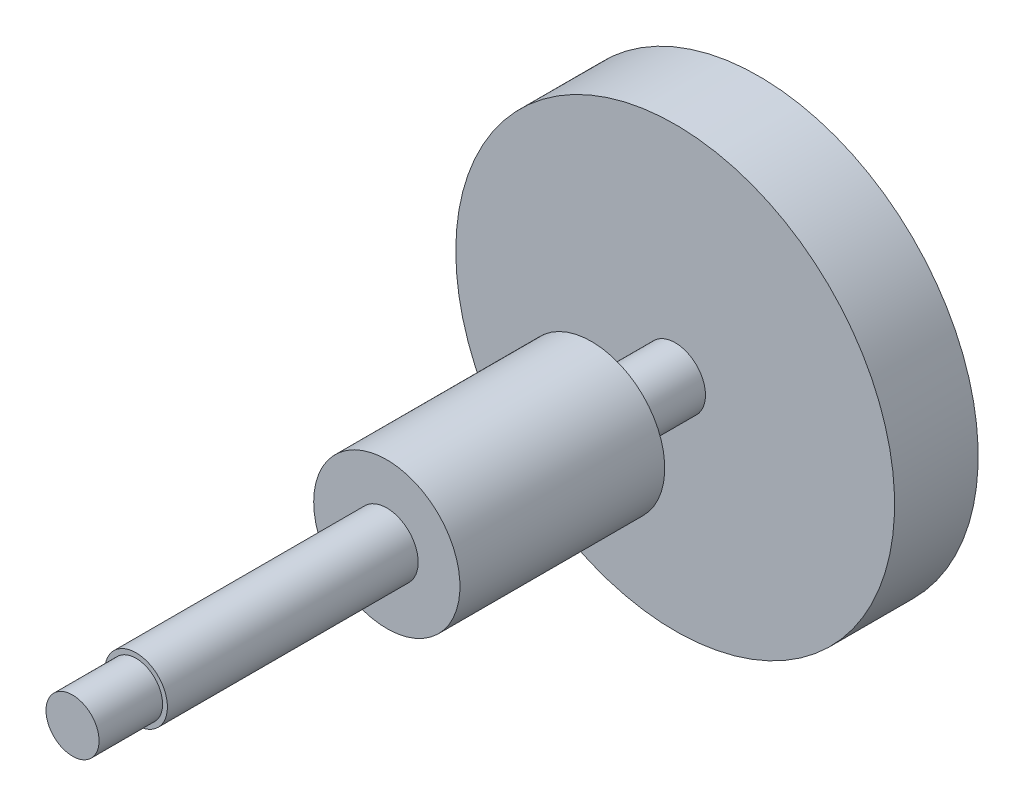
ISO-10303-21;
HEADER;
FILE_DESCRIPTION(('STEP AP214'),'2;1');
FILE_NAME('part.step','',(''),(''),'','','');
FILE_SCHEMA(('AUTOMOTIVE_DESIGN { 1 0 10303 214 1 1 1 1 }'));
ENDSEC;
DATA;
#1=APPLICATION_CONTEXT('core data for automotive mechanical design processes');
#2=APPLICATION_PROTOCOL_DEFINITION('international standard','automotive_design',2000,#1);
#3=PRODUCT_CONTEXT('',#1,'mechanical');
#4=PRODUCT('Part','Part','',(#3));
#5=PRODUCT_RELATED_PRODUCT_CATEGORY('part','',(#4));
#6=PRODUCT_DEFINITION_FORMATION('','',#4);
#7=PRODUCT_DEFINITION_CONTEXT('part definition',#1,'design');
#8=PRODUCT_DEFINITION('design','',#6,#7);
#9=PRODUCT_DEFINITION_SHAPE('','',#8);
#10=(LENGTH_UNIT() NAMED_UNIT(*) SI_UNIT(.MILLI.,.METRE.));
#11=(NAMED_UNIT(*) PLANE_ANGLE_UNIT() SI_UNIT($,.RADIAN.));
#12=(NAMED_UNIT(*) SI_UNIT($,.STERADIAN.) SOLID_ANGLE_UNIT());
#13=UNCERTAINTY_MEASURE_WITH_UNIT(LENGTH_MEASURE(1.E-05),#10,'distance_accuracy_value','');
#14=(GEOMETRIC_REPRESENTATION_CONTEXT(3) GLOBAL_UNCERTAINTY_ASSIGNED_CONTEXT((#13)) GLOBAL_UNIT_ASSIGNED_CONTEXT((#10,
#11,#12)) REPRESENTATION_CONTEXT('',''));
#15=CARTESIAN_POINT('',(0.,0.,0.));
#16=DIRECTION('',(0.,0.,1.));
#17=DIRECTION('',(1.,0.,0.));
#18=AXIS2_PLACEMENT_3D('',#15,#16,#17);
#19=CARTESIAN_POINT('',(-0.32131,-0.32131,8.21));
#20=DIRECTION('',(0.,0.,1.));
#21=DIRECTION('',(1.,0.,0.));
#22=AXIS2_PLACEMENT_3D('',#19,#20,#21);
#23=PLANE('',#22);
#24=CARTESIAN_POINT('',(0.,0.,8.21));
#25=DIRECTION('',(0.,0.,-1.));
#26=DIRECTION('',(-1.,0.,0.));
#27=AXIS2_PLACEMENT_3D('',#24,#25,#26);
#28=CIRCLE('',#27,0.3175);
#29=CARTESIAN_POINT('',(-0.3175,0.,8.21));
#30=VERTEX_POINT('',#29);
#31=EDGE_CURVE('E19',#30,#30,#28,.F.);
#32=ORIENTED_EDGE('',*,*,#31,.T.);
#33=EDGE_LOOP('',(#32));
#34=FACE_BOUND('',#33,.T.);
#35=ADVANCED_FACE('F15',(#34),#23,.T.);
#36=CARTESIAN_POINT('',(0.,0.,8.21));
#37=DIRECTION('',(0.,0.,-1.));
#38=DIRECTION('',(-1.,0.,0.));
#39=AXIS2_PLACEMENT_3D('',#36,#37,#38);
#40=CYLINDRICAL_SURFACE('',#39,0.3175);
#41=CARTESIAN_POINT('',(0.,0.,7.45));
#42=DIRECTION('',(0.,0.,-1.));
#43=DIRECTION('',(-1.,0.,0.));
#44=AXIS2_PLACEMENT_3D('',#41,#42,#43);
#45=CIRCLE('',#44,0.3175);
#46=CARTESIAN_POINT('',(-0.3175,0.,7.45));
#47=VERTEX_POINT('',#46);
#48=EDGE_CURVE('E53',#47,#47,#45,.T.);
#49=ORIENTED_EDGE('',*,*,#48,.F.);
#50=EDGE_LOOP('',(#49));
#51=FACE_BOUND('',#50,.T.);
#52=ORIENTED_EDGE('',*,*,#31,.F.);
#53=EDGE_LOOP('',(#52));
#54=FACE_BOUND('',#53,.T.);
#55=ADVANCED_FACE('F61',(#51,#54),#40,.T.);
#56=CARTESIAN_POINT('',(-0.3795,-0.3795,7.45));
#57=DIRECTION('',(0.,0.,1.));
#58=DIRECTION('',(1.,0.,0.));
#59=AXIS2_PLACEMENT_3D('',#56,#57,#58);
#60=PLANE('',#59);
#61=ORIENTED_EDGE('',*,*,#48,.T.);
#62=EDGE_LOOP('',(#61));
#63=FACE_BOUND('',#62,.T.);
#64=CARTESIAN_POINT('',(0.,0.,7.45));
#65=DIRECTION('',(0.,0.,-1.));
#66=DIRECTION('',(0.,1.,0.));
#67=AXIS2_PLACEMENT_3D('',#64,#65,#66);
#68=CIRCLE('',#67,0.375);
#69=CARTESIAN_POINT('',(0.,0.375,7.45));
#70=VERTEX_POINT('',#69);
#71=EDGE_CURVE('E51',#70,#70,#68,.F.);
#72=ORIENTED_EDGE('',*,*,#71,.T.);
#73=EDGE_LOOP('',(#72));
#74=FACE_BOUND('',#73,.T.);
#75=ADVANCED_FACE('F63',(#63,#74),#60,.T.);
#76=CARTESIAN_POINT('',(0.,0.,7.45));
#77=DIRECTION('',(0.,0.,-1.));
#78=DIRECTION('',(0.,1.,0.));
#79=AXIS2_PLACEMENT_3D('',#76,#77,#78);
#80=CYLINDRICAL_SURFACE('',#79,0.375);
#81=CARTESIAN_POINT('',(0.,0.,4.45));
#82=DIRECTION('',(0.,0.,-1.));
#83=DIRECTION('',(0.,1.,0.));
#84=AXIS2_PLACEMENT_3D('',#81,#82,#83);
#85=CIRCLE('',#84,0.375);
#86=CARTESIAN_POINT('',(0.,0.374999999999997,4.45));
#87=VERTEX_POINT('',#86);
#88=EDGE_CURVE('E48',#87,#87,#85,.T.);
#89=ORIENTED_EDGE('',*,*,#88,.F.);
#90=EDGE_LOOP('',(#89));
#91=FACE_BOUND('',#90,.T.);
#92=ORIENTED_EDGE('',*,*,#71,.F.);
#93=EDGE_LOOP('',(#92));
#94=FACE_BOUND('',#93,.T.);
#95=ADVANCED_FACE('F71',(#91,#94),#80,.T.);
#96=CARTESIAN_POINT('',(-0.8855,-0.8855,4.45));
#97=DIRECTION('',(0.,0.,1.));
#98=DIRECTION('',(1.,0.,0.));
#99=AXIS2_PLACEMENT_3D('',#96,#97,#98);
#100=PLANE('',#99);
#101=ORIENTED_EDGE('',*,*,#88,.T.);
#102=EDGE_LOOP('',(#101));
#103=FACE_BOUND('',#102,.T.);
#104=CARTESIAN_POINT('',(0.,0.,4.45));
#105=DIRECTION('',(0.,0.,-1.));
#106=DIRECTION('',(-1.,0.,0.));
#107=AXIS2_PLACEMENT_3D('',#104,#105,#106);
#108=CIRCLE('',#107,0.875);
#109=CARTESIAN_POINT('',(-0.875,0.,4.45));
#110=VERTEX_POINT('',#109);
#111=EDGE_CURVE('E45',#110,#110,#108,.F.);
#112=ORIENTED_EDGE('',*,*,#111,.T.);
#113=EDGE_LOOP('',(#112));
#114=FACE_BOUND('',#113,.T.);
#115=ADVANCED_FACE('F98',(#103,#114),#100,.T.);
#116=CARTESIAN_POINT('',(0.,0.,4.45));
#117=DIRECTION('',(0.,0.,-1.));
#118=DIRECTION('',(-1.,0.,0.));
#119=AXIS2_PLACEMENT_3D('',#116,#117,#118);
#120=CYLINDRICAL_SURFACE('',#119,0.875);
#121=ORIENTED_EDGE('',*,*,#111,.F.);
#122=EDGE_LOOP('',(#121));
#123=FACE_BOUND('',#122,.T.);
#124=CARTESIAN_POINT('',(0.,0.,2.));
#125=DIRECTION('',(0.,0.,-1.));
#126=DIRECTION('',(-1.,0.,0.));
#127=AXIS2_PLACEMENT_3D('',#124,#125,#126);
#128=CIRCLE('',#127,0.875);
#129=CARTESIAN_POINT('',(-0.875,0.,2.));
#130=VERTEX_POINT('',#129);
#131=EDGE_CURVE('E42',#130,#130,#128,.F.);
#132=ORIENTED_EDGE('',*,*,#131,.T.);
#133=EDGE_LOOP('',(#132));
#134=FACE_BOUND('',#133,.T.);
#135=ADVANCED_FACE('F96',(#123,#134),#120,.T.);
#136=CARTESIAN_POINT('',(-0.8855,-0.8855,2.));
#137=DIRECTION('',(0.,0.,1.));
#138=DIRECTION('',(1.,0.,0.));
#139=AXIS2_PLACEMENT_3D('',#136,#137,#138);
#140=PLANE('',#139);
#141=CARTESIAN_POINT('',(0.,0.,2.));
#142=DIRECTION('',(0.,0.,-1.));
#143=DIRECTION('',(-1.,0.,0.));
#144=AXIS2_PLACEMENT_3D('',#141,#142,#143);
#145=CIRCLE('',#144,0.3625);
#146=CARTESIAN_POINT('',(-0.3625,0.,2.));
#147=VERTEX_POINT('',#146);
#148=EDGE_CURVE('E39',#147,#147,#145,.F.);
#149=ORIENTED_EDGE('',*,*,#148,.T.);
#150=EDGE_LOOP('',(#149));
#151=FACE_BOUND('',#150,.T.);
#152=ORIENTED_EDGE('',*,*,#131,.F.);
#153=EDGE_LOOP('',(#152));
#154=FACE_BOUND('',#153,.T.);
#155=ADVANCED_FACE('F94',(#151,#154),#140,.F.);
#156=CARTESIAN_POINT('',(0.,0.,2.));
#157=DIRECTION('',(0.,0.,-1.));
#158=DIRECTION('',(-1.,0.,0.));
#159=AXIS2_PLACEMENT_3D('',#156,#157,#158);
#160=CYLINDRICAL_SURFACE('',#159,0.3625);
#161=CARTESIAN_POINT('',(0.,0.,1.));
#162=DIRECTION('',(0.,0.,-1.));
#163=DIRECTION('',(-1.,0.,0.));
#164=AXIS2_PLACEMENT_3D('',#161,#162,#163);
#165=CIRCLE('',#164,0.3625);
#166=CARTESIAN_POINT('',(-0.3625,0.,1.));
#167=VERTEX_POINT('',#166);
#168=EDGE_CURVE('E36',#167,#167,#165,.T.);
#169=ORIENTED_EDGE('',*,*,#168,.F.);
#170=EDGE_LOOP('',(#169));
#171=FACE_BOUND('',#170,.T.);
#172=ORIENTED_EDGE('',*,*,#148,.F.);
#173=EDGE_LOOP('',(#172));
#174=FACE_BOUND('',#173,.T.);
#175=ADVANCED_FACE('F91',(#171,#174),#160,.T.);
#176=CARTESIAN_POINT('',(-2.6565,-2.6565,1.));
#177=DIRECTION('',(0.,0.,1.));
#178=DIRECTION('',(1.,0.,0.));
#179=AXIS2_PLACEMENT_3D('',#176,#177,#178);
#180=PLANE('',#179);
#181=ORIENTED_EDGE('',*,*,#168,.T.);
#182=EDGE_LOOP('',(#181));
#183=FACE_BOUND('',#182,.T.);
#184=CARTESIAN_POINT('',(0.,0.,1.));
#185=DIRECTION('',(0.,0.,-1.));
#186=DIRECTION('',(-1.,0.,0.));
#187=AXIS2_PLACEMENT_3D('',#184,#185,#186);
#188=CIRCLE('',#187,2.625);
#189=CARTESIAN_POINT('',(-2.625,0.,1.));
#190=VERTEX_POINT('',#189);
#191=EDGE_CURVE('E33',#190,#190,#188,.F.);
#192=ORIENTED_EDGE('',*,*,#191,.T.);
#193=EDGE_LOOP('',(#192));
#194=FACE_BOUND('',#193,.T.);
#195=ADVANCED_FACE('F89',(#183,#194),#180,.T.);
#196=CARTESIAN_POINT('',(0.,0.,1.));
#197=DIRECTION('',(0.,0.,-1.));
#198=DIRECTION('',(-1.,0.,0.));
#199=AXIS2_PLACEMENT_3D('',#196,#197,#198);
#200=CYLINDRICAL_SURFACE('',#199,2.625);
#201=ORIENTED_EDGE('',*,*,#191,.F.);
#202=EDGE_LOOP('',(#201));
#203=FACE_BOUND('',#202,.T.);
#204=CARTESIAN_POINT('',(0.,0.,0.));
#205=DIRECTION('',(0.,0.,-1.));
#206=DIRECTION('',(-1.,0.,0.));
#207=AXIS2_PLACEMENT_3D('',#204,#205,#206);
#208=CIRCLE('',#207,2.625);
#209=CARTESIAN_POINT('',(-2.625,0.,0.));
#210=VERTEX_POINT('',#209);
#211=EDGE_CURVE('E28',#210,#210,#208,.F.);
#212=ORIENTED_EDGE('',*,*,#211,.T.);
#213=EDGE_LOOP('',(#212));
#214=FACE_BOUND('',#213,.T.);
#215=ADVANCED_FACE('F86',(#203,#214),#200,.T.);
#216=CARTESIAN_POINT('',(-2.6565,-2.6565,0.));
#217=DIRECTION('',(0.,0.,1.));
#218=DIRECTION('',(1.,0.,0.));
#219=AXIS2_PLACEMENT_3D('',#216,#217,#218);
#220=PLANE('',#219);
#221=CARTESIAN_POINT('',(0.,0.,0.));
#222=DIRECTION('',(0.,0.,1.));
#223=DIRECTION('',(1.,0.,0.));
#224=AXIS2_PLACEMENT_3D('',#221,#222,#223);
#225=CIRCLE('',#224,0.3175);
#226=CARTESIAN_POINT('',(0.3175,0.,0.));
#227=VERTEX_POINT('',#226);
#228=EDGE_CURVE('E23',#227,#227,#225,.T.);
#229=ORIENTED_EDGE('',*,*,#228,.T.);
#230=EDGE_LOOP('',(#229));
#231=FACE_BOUND('',#230,.T.);
#232=ORIENTED_EDGE('',*,*,#211,.F.);
#233=EDGE_LOOP('',(#232));
#234=FACE_BOUND('',#233,.T.);
#235=ADVANCED_FACE('F82',(#231,#234),#220,.F.);
#236=CARTESIAN_POINT('',(0.32131,-0.32131,-0.76));
#237=DIRECTION('',(0.,0.,-1.));
#238=DIRECTION('',(-1.,0.,0.));
#239=AXIS2_PLACEMENT_3D('',#236,#237,#238);
#240=PLANE('',#239);
#241=CARTESIAN_POINT('',(0.,0.,-0.76));
#242=DIRECTION('',(0.,0.,1.));
#243=DIRECTION('',(1.,0.,0.));
#244=AXIS2_PLACEMENT_3D('',#241,#242,#243);
#245=CIRCLE('',#244,0.3175);
#246=CARTESIAN_POINT('',(0.3175,0.,-0.76));
#247=VERTEX_POINT('',#246);
#248=EDGE_CURVE('E10',#247,#247,#245,.F.);
#249=ORIENTED_EDGE('',*,*,#248,.T.);
#250=EDGE_LOOP('',(#249));
#251=FACE_BOUND('',#250,.T.);
#252=ADVANCED_FACE('F17',(#251),#240,.T.);
#253=CARTESIAN_POINT('',(0.,0.,-0.76));
#254=DIRECTION('',(0.,0.,1.));
#255=DIRECTION('',(1.,0.,0.));
#256=AXIS2_PLACEMENT_3D('',#253,#254,#255);
#257=CYLINDRICAL_SURFACE('',#256,0.3175);
#258=ORIENTED_EDGE('',*,*,#228,.F.);
#259=EDGE_LOOP('',(#258));
#260=FACE_BOUND('',#259,.T.);
#261=ORIENTED_EDGE('',*,*,#248,.F.);
#262=EDGE_LOOP('',(#261));
#263=FACE_BOUND('',#262,.T.);
#264=ADVANCED_FACE('F75',(#260,#263),#257,.T.);
#265=CLOSED_SHELL('',(#35,#55,#75,#95,#115,#135,#155,#175,#195,#215,#235,#252,#264));
#266=MANIFOLD_SOLID_BREP('B1',#265);
#267=ADVANCED_BREP_SHAPE_REPRESENTATION('',(#18,#266),#14);
#268=SHAPE_DEFINITION_REPRESENTATION(#9,#267);
ENDSEC;
END-ISO-10303-21;
